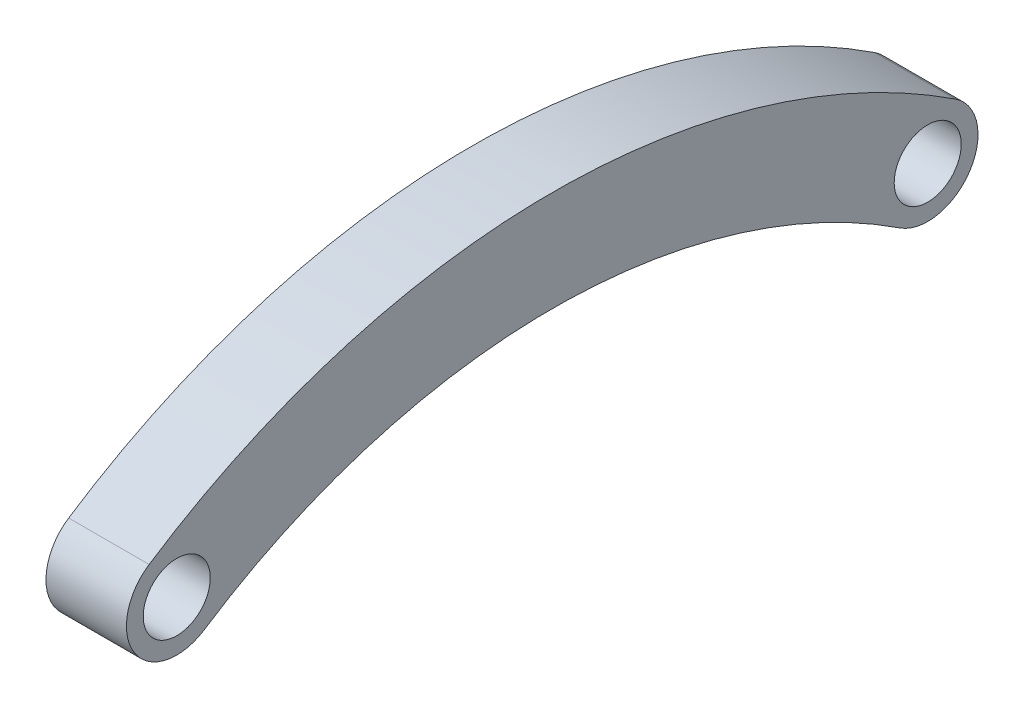
ISO-10303-21;
HEADER;
FILE_DESCRIPTION(('STEP AP214'),'2;1');
FILE_NAME('part.step','',(''),(''),'','','');
FILE_SCHEMA(('AUTOMOTIVE_DESIGN { 1 0 10303 214 1 1 1 1 }'));
ENDSEC;
DATA;
#1=APPLICATION_CONTEXT('core data for automotive mechanical design processes');
#2=APPLICATION_PROTOCOL_DEFINITION('international standard','automotive_design',2000,#1);
#3=PRODUCT_CONTEXT('',#1,'mechanical');
#4=PRODUCT('Part','Part','',(#3));
#5=PRODUCT_RELATED_PRODUCT_CATEGORY('part','',(#4));
#6=PRODUCT_DEFINITION_FORMATION('','',#4);
#7=PRODUCT_DEFINITION_CONTEXT('part definition',#1,'design');
#8=PRODUCT_DEFINITION('design','',#6,#7);
#9=PRODUCT_DEFINITION_SHAPE('','',#8);
#10=(LENGTH_UNIT() NAMED_UNIT(*) SI_UNIT(.MILLI.,.METRE.));
#11=(NAMED_UNIT(*) PLANE_ANGLE_UNIT() SI_UNIT($,.RADIAN.));
#12=(NAMED_UNIT(*) SI_UNIT($,.STERADIAN.) SOLID_ANGLE_UNIT());
#13=UNCERTAINTY_MEASURE_WITH_UNIT(LENGTH_MEASURE(1.E-05),#10,'distance_accuracy_value','');
#14=(GEOMETRIC_REPRESENTATION_CONTEXT(3) GLOBAL_UNCERTAINTY_ASSIGNED_CONTEXT((#13)) GLOBAL_UNIT_ASSIGNED_CONTEXT((#10,
#11,#12)) REPRESENTATION_CONTEXT('',''));
#15=CARTESIAN_POINT('',(0.,0.,0.));
#16=DIRECTION('',(0.,0.,1.));
#17=DIRECTION('',(1.,0.,0.));
#18=AXIS2_PLACEMENT_3D('',#15,#16,#17);
#19=CARTESIAN_POINT('',(2.399999953,-3.69999999999996,-22.4));
#20=DIRECTION('',(-1.,0.,0.));
#21=DIRECTION('',(0.,0.,1.));
#22=AXIS2_PLACEMENT_3D('',#19,#20,#21);
#23=CYLINDRICAL_SURFACE('',#22,3.);
#24=CARTESIAN_POINT('',(-2.399999953,-3.69999999999996,-22.4));
#25=DIRECTION('',(1.,0.,0.));
#26=DIRECTION('',(0.,0.,-1.));
#27=AXIS2_PLACEMENT_3D('',#24,#25,#26);
#28=CIRCLE('',#27,3.);
#29=CARTESIAN_POINT('',(-2.399999953,-6.20728985639803,-20.7527302661666));
#30=VERTEX_POINT('',#29);
#31=CARTESIAN_POINT('',(-2.399999953,-1.19271014360174,-24.0472697338334));
#32=VERTEX_POINT('',#31);
#33=EDGE_CURVE('E101',#30,#32,#28,.T.);
#34=ORIENTED_EDGE('',*,*,#33,.T.);
#35=DIRECTION('',(-1.,0.,0.));
#36=VECTOR('',#35,1.);
#37=CARTESIAN_POINT('',(2.399999953,-1.19271014360174,-24.0472697338334));
#38=LINE('',#37,#36);
#39=CARTESIAN_POINT('',(2.399999953,-1.19271014360174,-24.0472697338334));
#40=VERTEX_POINT('',#39);
#41=EDGE_CURVE('E11',#40,#32,#38,.T.);
#42=ORIENTED_EDGE('',*,*,#41,.F.);
#43=CARTESIAN_POINT('',(2.399999953,-3.69999999999996,-22.4));
#44=DIRECTION('',(1.,0.,0.));
#45=DIRECTION('',(0.,0.,-1.));
#46=AXIS2_PLACEMENT_3D('',#43,#44,#45);
#47=CIRCLE('',#46,3.);
#48=CARTESIAN_POINT('',(2.399999953,-6.20728985639803,-20.7527302661666));
#49=VERTEX_POINT('',#48);
#50=EDGE_CURVE('E87',#49,#40,#47,.T.);
#51=ORIENTED_EDGE('',*,*,#50,.F.);
#52=DIRECTION('',(-1.,0.,0.));
#53=VECTOR('',#52,1.);
#54=CARTESIAN_POINT('',(2.399999953,-6.20728985639803,-20.7527302661666));
#55=LINE('',#54,#53);
#56=EDGE_CURVE('E97',#49,#30,#55,.T.);
#57=ORIENTED_EDGE('',*,*,#56,.T.);
#58=EDGE_LOOP('',(#34,#42,#51,#57));
#59=FACE_BOUND('',#58,.T.);
#60=ADVANCED_FACE('F37',(#59),#23,.T.);
#61=CARTESIAN_POINT('',(2.399999953,-37.7947761194029,0.));
#62=DIRECTION('',(-1.,0.,0.));
#63=DIRECTION('',(0.,0.,1.));
#64=AXIS2_PLACEMENT_3D('',#61,#62,#63);
#65=CYLINDRICAL_SURFACE('',#64,43.7947761194032);
#66=CARTESIAN_POINT('',(-2.399999953,-37.7947761194029,0.));
#67=DIRECTION('',(1.,0.,0.));
#68=DIRECTION('',(0.,0.,-1.));
#69=AXIS2_PLACEMENT_3D('',#66,#67,#68);
#70=CIRCLE('',#69,43.7947761194032);
#71=CARTESIAN_POINT('',(-2.399999953,-1.1927101436019,24.0472697338333));
#72=VERTEX_POINT('',#71);
#73=EDGE_CURVE('E92',#32,#72,#70,.T.);
#74=ORIENTED_EDGE('',*,*,#73,.T.);
#75=DIRECTION('',(-1.,0.,0.));
#76=VECTOR('',#75,1.);
#77=CARTESIAN_POINT('',(2.399999953,-1.1927101436019,24.0472697338333));
#78=LINE('',#77,#76);
#79=CARTESIAN_POINT('',(2.399999953,-1.1927101436019,24.0472697338333));
#80=VERTEX_POINT('',#79);
#81=EDGE_CURVE('E45',#80,#72,#78,.T.);
#82=ORIENTED_EDGE('',*,*,#81,.F.);
#83=CARTESIAN_POINT('',(2.399999953,-37.7947761194029,0.));
#84=DIRECTION('',(1.,0.,0.));
#85=DIRECTION('',(0.,0.,1.));
#86=AXIS2_PLACEMENT_3D('',#83,#84,#85);
#87=CIRCLE('',#86,43.7947761194032);
#88=EDGE_CURVE('E81',#40,#80,#87,.T.);
#89=ORIENTED_EDGE('',*,*,#88,.F.);
#90=ORIENTED_EDGE('',*,*,#41,.T.);
#91=EDGE_LOOP('',(#74,#82,#89,#90));
#92=FACE_BOUND('',#91,.T.);
#93=ADVANCED_FACE('F91',(#92),#65,.T.);
#94=CARTESIAN_POINT('',(2.399999953,-3.69999999999996,22.4));
#95=DIRECTION('',(-1.,0.,0.));
#96=DIRECTION('',(0.,0.,1.));
#97=AXIS2_PLACEMENT_3D('',#94,#95,#96);
#98=CYLINDRICAL_SURFACE('',#97,3.);
#99=CARTESIAN_POINT('',(-2.399999953,-3.69999999999996,22.4));
#100=DIRECTION('',(1.,0.,0.));
#101=DIRECTION('',(0.,0.,1.));
#102=AXIS2_PLACEMENT_3D('',#99,#100,#101);
#103=CIRCLE('',#102,3.);
#104=CARTESIAN_POINT('',(-2.399999953,-6.20728985639803,20.7527302661666));
#105=VERTEX_POINT('',#104);
#106=EDGE_CURVE('E106',#72,#105,#103,.T.);
#107=ORIENTED_EDGE('',*,*,#106,.T.);
#108=DIRECTION('',(-1.,0.,0.));
#109=VECTOR('',#108,1.);
#110=CARTESIAN_POINT('',(2.399999953,-6.20728985639803,20.7527302661666));
#111=LINE('',#110,#109);
#112=CARTESIAN_POINT('',(2.399999953,-6.20728985639803,20.7527302661666));
#113=VERTEX_POINT('',#112);
#114=EDGE_CURVE('E94',#113,#105,#111,.T.);
#115=ORIENTED_EDGE('',*,*,#114,.F.);
#116=CARTESIAN_POINT('',(2.399999953,-3.69999999999996,22.4));
#117=DIRECTION('',(1.,0.,0.));
#118=DIRECTION('',(0.,0.,1.));
#119=AXIS2_PLACEMENT_3D('',#116,#117,#118);
#120=CIRCLE('',#119,3.);
#121=EDGE_CURVE('E84',#80,#113,#120,.T.);
#122=ORIENTED_EDGE('',*,*,#121,.F.);
#123=ORIENTED_EDGE('',*,*,#81,.T.);
#124=EDGE_LOOP('',(#107,#115,#122,#123));
#125=FACE_BOUND('',#124,.T.);
#126=ADVANCED_FACE('F95',(#125),#98,.T.);
#127=CARTESIAN_POINT('',(2.399999953,-37.7947761194029,0.));
#128=DIRECTION('',(-1.,0.,0.));
#129=DIRECTION('',(0.,0.,1.));
#130=AXIS2_PLACEMENT_3D('',#127,#128,#129);
#131=CYLINDRICAL_SURFACE('',#130,37.794776119403);
#132=CARTESIAN_POINT('',(-2.399999953,-37.7947761194029,0.));
#133=DIRECTION('',(-1.,0.,0.));
#134=DIRECTION('',(0.,0.,1.));
#135=AXIS2_PLACEMENT_3D('',#132,#133,#134);
#136=CIRCLE('',#135,37.794776119403);
#137=EDGE_CURVE('E70',#105,#30,#136,.T.);
#138=ORIENTED_EDGE('',*,*,#137,.T.);
#139=ORIENTED_EDGE('',*,*,#56,.F.);
#140=CARTESIAN_POINT('',(2.399999953,-37.7947761194029,0.));
#141=DIRECTION('',(-1.,0.,0.));
#142=DIRECTION('',(0.,0.,-1.));
#143=AXIS2_PLACEMENT_3D('',#140,#141,#142);
#144=CIRCLE('',#143,37.794776119403);
#145=EDGE_CURVE('E53',#113,#49,#144,.T.);
#146=ORIENTED_EDGE('',*,*,#145,.F.);
#147=ORIENTED_EDGE('',*,*,#114,.T.);
#148=EDGE_LOOP('',(#138,#139,#146,#147));
#149=FACE_BOUND('',#148,.T.);
#150=ADVANCED_FACE('F110',(#149),#131,.F.);
#151=CARTESIAN_POINT('',(2.399999953,-20.7473880597014,-11.2));
#152=DIRECTION('',(1.,0.,0.));
#153=DIRECTION('',(0.,0.,-1.));
#154=AXIS2_PLACEMENT_3D('',#151,#152,#153);
#155=PLANE('',#154);
#156=CARTESIAN_POINT('',(2.399999953,-3.69999999999996,22.4));
#157=DIRECTION('',(1.,0.,0.));
#158=DIRECTION('',(0.,0.,-1.));
#159=AXIS2_PLACEMENT_3D('',#156,#157,#158);
#160=CIRCLE('',#159,2.);
#161=CARTESIAN_POINT('',(2.399999953,-3.69999999999996,20.4));
#162=VERTEX_POINT('',#161);
#163=EDGE_CURVE('E116',#162,#162,#160,.T.);
#164=ORIENTED_EDGE('',*,*,#163,.F.);
#165=EDGE_LOOP('',(#164));
#166=FACE_BOUND('',#165,.T.);
#167=CARTESIAN_POINT('',(2.399999953,-3.69999999999996,-22.4));
#168=DIRECTION('',(1.,0.,0.));
#169=DIRECTION('',(0.,0.,1.));
#170=AXIS2_PLACEMENT_3D('',#167,#168,#169);
#171=CIRCLE('',#170,2.);
#172=CARTESIAN_POINT('',(2.399999953,-3.69999999999996,-20.4));
#173=VERTEX_POINT('',#172);
#174=EDGE_CURVE('E113',#173,#173,#171,.T.);
#175=ORIENTED_EDGE('',*,*,#174,.F.);
#176=EDGE_LOOP('',(#175));
#177=FACE_BOUND('',#176,.T.);
#178=ORIENTED_EDGE('',*,*,#50,.T.);
#179=ORIENTED_EDGE('',*,*,#88,.T.);
#180=ORIENTED_EDGE('',*,*,#121,.T.);
#181=ORIENTED_EDGE('',*,*,#145,.T.);
#182=EDGE_LOOP('',(#178,#179,#180,#181));
#183=FACE_BOUND('',#182,.T.);
#184=ADVANCED_FACE('F82',(#166,#177,#183),#155,.T.);
#185=CARTESIAN_POINT('',(-2.399999953,-20.7473880597014,-11.2));
#186=DIRECTION('',(1.,0.,0.));
#187=DIRECTION('',(0.,0.,-1.));
#188=AXIS2_PLACEMENT_3D('',#185,#186,#187);
#189=PLANE('',#188);
#190=CARTESIAN_POINT('',(-2.399999953,-3.69999999999996,22.4));
#191=DIRECTION('',(1.,0.,0.));
#192=DIRECTION('',(0.,0.,-1.));
#193=AXIS2_PLACEMENT_3D('',#190,#191,#192);
#194=CIRCLE('',#193,2.);
#195=CARTESIAN_POINT('',(-2.399999953,-3.69999999999996,20.4));
#196=VERTEX_POINT('',#195);
#197=EDGE_CURVE('E104',#196,#196,#194,.F.);
#198=ORIENTED_EDGE('',*,*,#197,.F.);
#199=EDGE_LOOP('',(#198));
#200=FACE_BOUND('',#199,.T.);
#201=CARTESIAN_POINT('',(-2.399999953,-3.69999999999996,-22.4));
#202=DIRECTION('',(1.,0.,0.));
#203=DIRECTION('',(0.,0.,-1.));
#204=AXIS2_PLACEMENT_3D('',#201,#202,#203);
#205=CIRCLE('',#204,2.);
#206=CARTESIAN_POINT('',(-2.399999953,-3.69999999999996,-24.4));
#207=VERTEX_POINT('',#206);
#208=EDGE_CURVE('E117',#207,#207,#205,.F.);
#209=ORIENTED_EDGE('',*,*,#208,.F.);
#210=EDGE_LOOP('',(#209));
#211=FACE_BOUND('',#210,.T.);
#212=ORIENTED_EDGE('',*,*,#33,.F.);
#213=ORIENTED_EDGE('',*,*,#137,.F.);
#214=ORIENTED_EDGE('',*,*,#106,.F.);
#215=ORIENTED_EDGE('',*,*,#73,.F.);
#216=EDGE_LOOP('',(#212,#213,#214,#215));
#217=FACE_BOUND('',#216,.T.);
#218=ADVANCED_FACE('F129',(#200,#211,#217),#189,.F.);
#219=CARTESIAN_POINT('',(-8.05685420249239,-3.69999999999996,-22.4));
#220=DIRECTION('',(1.,0.,0.));
#221=DIRECTION('',(0.,0.,-1.));
#222=AXIS2_PLACEMENT_3D('',#219,#220,#221);
#223=CYLINDRICAL_SURFACE('',#222,2.);
#224=ORIENTED_EDGE('',*,*,#208,.T.);
#225=EDGE_LOOP('',(#224));
#226=FACE_BOUND('',#225,.T.);
#227=ORIENTED_EDGE('',*,*,#174,.T.);
#228=EDGE_LOOP('',(#227));
#229=FACE_BOUND('',#228,.T.);
#230=ADVANCED_FACE('F133',(#226,#229),#223,.F.);
#231=CARTESIAN_POINT('',(-8.05685420249239,-3.69999999999996,22.4));
#232=DIRECTION('',(1.,0.,0.));
#233=DIRECTION('',(0.,0.,-1.));
#234=AXIS2_PLACEMENT_3D('',#231,#232,#233);
#235=CYLINDRICAL_SURFACE('',#234,2.);
#236=ORIENTED_EDGE('',*,*,#197,.T.);
#237=EDGE_LOOP('',(#236));
#238=FACE_BOUND('',#237,.T.);
#239=ORIENTED_EDGE('',*,*,#163,.T.);
#240=EDGE_LOOP('',(#239));
#241=FACE_BOUND('',#240,.T.);
#242=ADVANCED_FACE('F125',(#238,#241),#235,.F.);
#243=CLOSED_SHELL('',(#60,#93,#126,#150,#184,#218,#230,#242));
#244=MANIFOLD_SOLID_BREP('B2',#243);
#245=ADVANCED_BREP_SHAPE_REPRESENTATION('',(#18,#244),#14);
#246=SHAPE_DEFINITION_REPRESENTATION(#9,#245);
ENDSEC;
END-ISO-10303-21;
